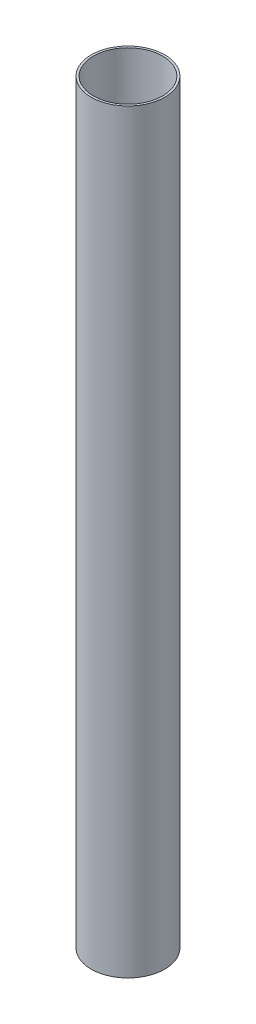
ISO-10303-21;
HEADER;
FILE_DESCRIPTION(('STEP AP214'),'2;1');
FILE_NAME('part.step','',(''),(''),'','','');
FILE_SCHEMA(('AUTOMOTIVE_DESIGN { 1 0 10303 214 1 1 1 1 }'));
ENDSEC;
DATA;
#1=APPLICATION_CONTEXT('core data for automotive mechanical design processes');
#2=APPLICATION_PROTOCOL_DEFINITION('international standard','automotive_design',2000,#1);
#3=PRODUCT_CONTEXT('',#1,'mechanical');
#4=PRODUCT('Part','Part','',(#3));
#5=PRODUCT_RELATED_PRODUCT_CATEGORY('part','',(#4));
#6=PRODUCT_DEFINITION_FORMATION('','',#4);
#7=PRODUCT_DEFINITION_CONTEXT('part definition',#1,'design');
#8=PRODUCT_DEFINITION('design','',#6,#7);
#9=PRODUCT_DEFINITION_SHAPE('','',#8);
#10=(LENGTH_UNIT() NAMED_UNIT(*) SI_UNIT(.MILLI.,.METRE.));
#11=(NAMED_UNIT(*) PLANE_ANGLE_UNIT() SI_UNIT($,.RADIAN.));
#12=(NAMED_UNIT(*) SI_UNIT($,.STERADIAN.) SOLID_ANGLE_UNIT());
#13=UNCERTAINTY_MEASURE_WITH_UNIT(LENGTH_MEASURE(1.E-05),#10,'distance_accuracy_value','');
#14=(GEOMETRIC_REPRESENTATION_CONTEXT(3) GLOBAL_UNCERTAINTY_ASSIGNED_CONTEXT((#13)) GLOBAL_UNIT_ASSIGNED_CONTEXT((#10,
#11,#12)) REPRESENTATION_CONTEXT('',''));
#15=CARTESIAN_POINT('',(0.,0.,0.));
#16=DIRECTION('',(0.,0.,1.));
#17=DIRECTION('',(1.,0.,0.));
#18=AXIS2_PLACEMENT_3D('',#15,#16,#17);
#19=CARTESIAN_POINT('',(0.,936.625,0.));
#20=DIRECTION('',(0.,1.,0.));
#21=DIRECTION('',(0.,0.,1.));
#22=AXIS2_PLACEMENT_3D('',#19,#20,#21);
#23=PLANE('',#22);
#24=CARTESIAN_POINT('',(0.,936.625,0.));
#25=DIRECTION('',(0.,1.,0.));
#26=DIRECTION('',(0.,0.,1.));
#27=AXIS2_PLACEMENT_3D('',#24,#25,#26);
#28=CIRCLE('',#27,45.5803);
#29=CARTESIAN_POINT('',(0.,936.625,45.5803));
#30=VERTEX_POINT('',#29);
#31=EDGE_CURVE('E10',#30,#30,#28,.T.);
#32=ORIENTED_EDGE('',*,*,#31,.T.);
#33=EDGE_LOOP('',(#32));
#34=FACE_BOUND('',#33,.T.);
#35=CARTESIAN_POINT('',(0.,936.625,0.));
#36=DIRECTION('',(0.,1.,0.));
#37=DIRECTION('',(0.,0.,1.));
#38=AXIS2_PLACEMENT_3D('',#35,#36,#37);
#39=CIRCLE('',#38,42.926);
#40=CARTESIAN_POINT('',(0.,936.625,42.926));
#41=VERTEX_POINT('',#40);
#42=EDGE_CURVE('E41',#41,#41,#39,.T.);
#43=ORIENTED_EDGE('',*,*,#42,.F.);
#44=EDGE_LOOP('',(#43));
#45=FACE_BOUND('',#44,.T.);
#46=ADVANCED_FACE('F30',(#34,#45),#23,.T.);
#47=CARTESIAN_POINT('',(0.,0.,0.));
#48=DIRECTION('',(0.,1.,0.));
#49=DIRECTION('',(0.,0.,1.));
#50=AXIS2_PLACEMENT_3D('',#47,#48,#49);
#51=PLANE('',#50);
#52=CARTESIAN_POINT('',(0.,0.,0.));
#53=DIRECTION('',(0.,1.,0.));
#54=DIRECTION('',(0.,0.,1.));
#55=AXIS2_PLACEMENT_3D('',#52,#53,#54);
#56=CIRCLE('',#55,45.5803);
#57=CARTESIAN_POINT('',(0.,0.,45.5803));
#58=VERTEX_POINT('',#57);
#59=EDGE_CURVE('E34',#58,#58,#56,.T.);
#60=ORIENTED_EDGE('',*,*,#59,.F.);
#61=EDGE_LOOP('',(#60));
#62=FACE_BOUND('',#61,.T.);
#63=CARTESIAN_POINT('',(0.,0.,0.));
#64=DIRECTION('',(0.,1.,0.));
#65=DIRECTION('',(0.,0.,1.));
#66=AXIS2_PLACEMENT_3D('',#63,#64,#65);
#67=CIRCLE('',#66,42.926);
#68=CARTESIAN_POINT('',(0.,0.,42.926));
#69=VERTEX_POINT('',#68);
#70=EDGE_CURVE('E43',#69,#69,#67,.T.);
#71=ORIENTED_EDGE('',*,*,#70,.T.);
#72=EDGE_LOOP('',(#71));
#73=FACE_BOUND('',#72,.T.);
#74=ADVANCED_FACE('F53',(#62,#73),#51,.F.);
#75=CARTESIAN_POINT('',(0.,936.625,0.));
#76=DIRECTION('',(0.,-1.,0.));
#77=DIRECTION('',(0.,0.,-1.));
#78=AXIS2_PLACEMENT_3D('',#75,#76,#77);
#79=CYLINDRICAL_SURFACE('',#78,45.5803);
#80=ORIENTED_EDGE('',*,*,#31,.F.);
#81=EDGE_LOOP('',(#80));
#82=FACE_BOUND('',#81,.T.);
#83=ORIENTED_EDGE('',*,*,#59,.T.);
#84=EDGE_LOOP('',(#83));
#85=FACE_BOUND('',#84,.T.);
#86=ADVANCED_FACE('F32',(#82,#85),#79,.T.);
#87=CARTESIAN_POINT('',(0.,936.625,0.));
#88=DIRECTION('',(0.,-1.,0.));
#89=DIRECTION('',(0.,0.,-1.));
#90=AXIS2_PLACEMENT_3D('',#87,#88,#89);
#91=CYLINDRICAL_SURFACE('',#90,42.926);
#92=ORIENTED_EDGE('',*,*,#42,.T.);
#93=EDGE_LOOP('',(#92));
#94=FACE_BOUND('',#93,.T.);
#95=ORIENTED_EDGE('',*,*,#70,.F.);
#96=EDGE_LOOP('',(#95));
#97=FACE_BOUND('',#96,.T.);
#98=ADVANCED_FACE('F49',(#94,#97),#91,.F.);
#99=CLOSED_SHELL('',(#46,#74,#86,#98));
#100=MANIFOLD_SOLID_BREP('B2',#99);
#101=ADVANCED_BREP_SHAPE_REPRESENTATION('',(#18,#100),#14);
#102=SHAPE_DEFINITION_REPRESENTATION(#9,#101);
ENDSEC;
END-ISO-10303-21;
